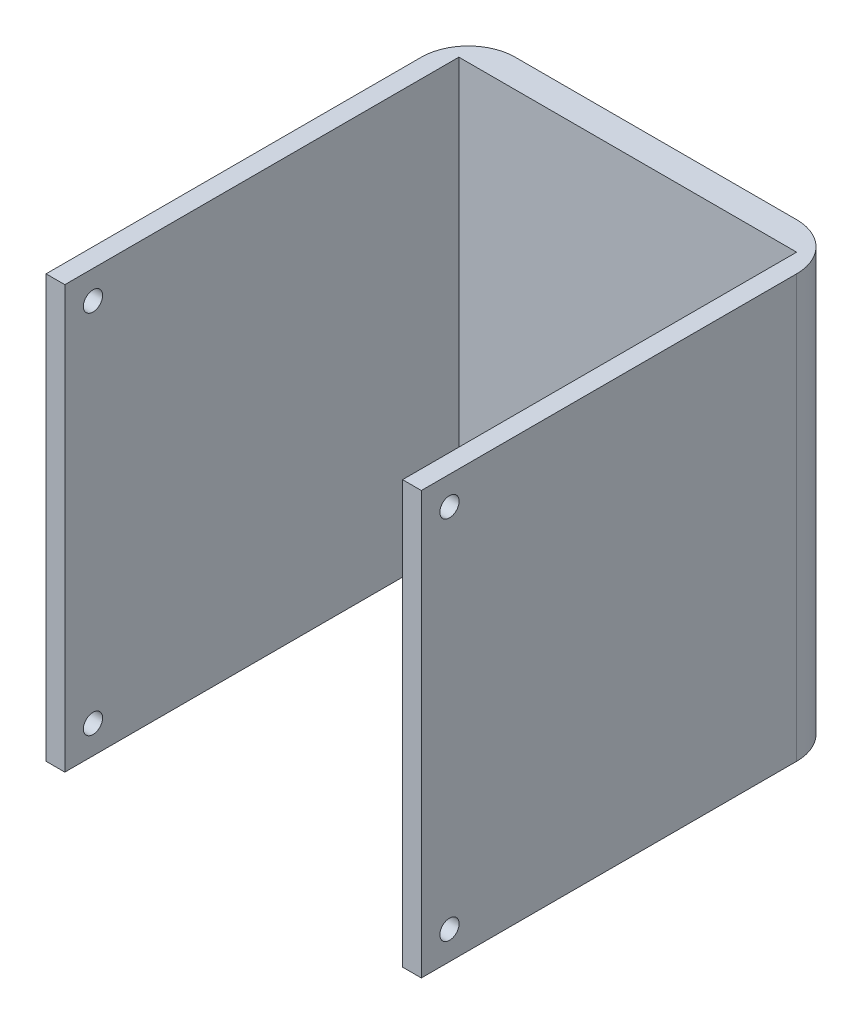
ISO-10303-21;
HEADER;
FILE_DESCRIPTION(('STEP AP214'),'2;1');
FILE_NAME('part.step','',(''),(''),'','','');
FILE_SCHEMA(('AUTOMOTIVE_DESIGN { 1 0 10303 214 1 1 1 1 }'));
ENDSEC;
DATA;
#1=APPLICATION_CONTEXT('core data for automotive mechanical design processes');
#2=APPLICATION_PROTOCOL_DEFINITION('international standard','automotive_design',2000,#1);
#3=PRODUCT_CONTEXT('',#1,'mechanical');
#4=PRODUCT('Part','Part','',(#3));
#5=PRODUCT_RELATED_PRODUCT_CATEGORY('part','',(#4));
#6=PRODUCT_DEFINITION_FORMATION('','',#4);
#7=PRODUCT_DEFINITION_CONTEXT('part definition',#1,'design');
#8=PRODUCT_DEFINITION('design','',#6,#7);
#9=PRODUCT_DEFINITION_SHAPE('','',#8);
#10=(LENGTH_UNIT() NAMED_UNIT(*) SI_UNIT(.MILLI.,.METRE.));
#11=(NAMED_UNIT(*) PLANE_ANGLE_UNIT() SI_UNIT($,.RADIAN.));
#12=(NAMED_UNIT(*) SI_UNIT($,.STERADIAN.) SOLID_ANGLE_UNIT());
#13=UNCERTAINTY_MEASURE_WITH_UNIT(LENGTH_MEASURE(1.E-05),#10,'distance_accuracy_value','');
#14=(GEOMETRIC_REPRESENTATION_CONTEXT(3) GLOBAL_UNCERTAINTY_ASSIGNED_CONTEXT((#13)) GLOBAL_UNIT_ASSIGNED_CONTEXT((#10,
#11,#12)) REPRESENTATION_CONTEXT('',''));
#15=CARTESIAN_POINT('',(0.,0.,0.));
#16=DIRECTION('',(0.,0.,1.));
#17=DIRECTION('',(1.,0.,0.));
#18=AXIS2_PLACEMENT_3D('',#15,#16,#17);
#19=CARTESIAN_POINT('',(20.4545454545455,0.,0.));
#20=DIRECTION('',(0.,1.,0.));
#21=DIRECTION('',(-1.,0.,0.));
#22=AXIS2_PLACEMENT_3D('',#19,#20,#21);
#23=CYLINDRICAL_SURFACE('',#22,5.);
#24=DIRECTION('',(0.,-1.,0.));
#25=VECTOR('',#24,1.);
#26=CARTESIAN_POINT('',(20.4545454545455,0.,-5.));
#27=LINE('',#26,#25);
#28=CARTESIAN_POINT('',(20.4545454545455,16.9090909090909,-5.));
#29=VERTEX_POINT('',#28);
#30=CARTESIAN_POINT('',(20.4545454545455,-28.0909090909091,-5.));
#31=VERTEX_POINT('',#30);
#32=EDGE_CURVE('E228',#29,#31,#27,.T.);
#33=ORIENTED_EDGE('',*,*,#32,.F.);
#34=CARTESIAN_POINT('',(20.4545454545455,16.9090909090909,0.));
#35=DIRECTION('',(0.,-1.,0.));
#36=DIRECTION('',(0.,0.,-1.));
#37=AXIS2_PLACEMENT_3D('',#34,#35,#36);
#38=CIRCLE('',#37,5.);
#39=CARTESIAN_POINT('',(25.4545454545455,16.9090909090909,0.));
#40=VERTEX_POINT('',#39);
#41=EDGE_CURVE('E47',#40,#29,#38,.F.);
#42=ORIENTED_EDGE('',*,*,#41,.F.);
#43=DIRECTION('',(0.,-1.,0.));
#44=VECTOR('',#43,1.);
#45=CARTESIAN_POINT('',(25.4545454545455,0.,0.));
#46=LINE('',#45,#44);
#47=CARTESIAN_POINT('',(25.4545454545455,-28.0909090909091,0.));
#48=VERTEX_POINT('',#47);
#49=EDGE_CURVE('E232',#48,#40,#46,.F.);
#50=ORIENTED_EDGE('',*,*,#49,.F.);
#51=CARTESIAN_POINT('',(20.4545454545455,-28.0909090909091,0.));
#52=DIRECTION('',(0.,-1.,0.));
#53=DIRECTION('',(0.,0.,-1.));
#54=AXIS2_PLACEMENT_3D('',#51,#52,#53);
#55=CIRCLE('',#54,5.);
#56=EDGE_CURVE('E11',#31,#48,#55,.T.);
#57=ORIENTED_EDGE('',*,*,#56,.F.);
#58=EDGE_LOOP('',(#33,#42,#50,#57));
#59=FACE_BOUND('',#58,.T.);
#60=ADVANCED_FACE('F39',(#59),#23,.T.);
#61=CARTESIAN_POINT('',(-9.54545454545454,0.,0.));
#62=DIRECTION('',(0.,1.,0.));
#63=DIRECTION('',(-1.,0.,0.));
#64=AXIS2_PLACEMENT_3D('',#61,#62,#63);
#65=CYLINDRICAL_SURFACE('',#64,5.);
#66=DIRECTION('',(0.,1.,0.));
#67=VECTOR('',#66,1.);
#68=CARTESIAN_POINT('',(-9.54545454545454,0.,-5.));
#69=LINE('',#68,#67);
#70=CARTESIAN_POINT('',(-9.54545454545454,-28.0909090909091,-5.));
#71=VERTEX_POINT('',#70);
#72=CARTESIAN_POINT('',(-9.54545454545455,16.9090909090909,-5.));
#73=VERTEX_POINT('',#72);
#74=EDGE_CURVE('E214',#71,#73,#69,.T.);
#75=ORIENTED_EDGE('',*,*,#74,.F.);
#76=CARTESIAN_POINT('',(-9.54545454545454,-28.0909090909091,0.));
#77=DIRECTION('',(0.,-1.,0.));
#78=DIRECTION('',(0.,0.,-1.));
#79=AXIS2_PLACEMENT_3D('',#76,#77,#78);
#80=CIRCLE('',#79,5.);
#81=CARTESIAN_POINT('',(-14.5454545454545,-28.0909090909091,0.));
#82=VERTEX_POINT('',#81);
#83=EDGE_CURVE('E222',#82,#71,#80,.T.);
#84=ORIENTED_EDGE('',*,*,#83,.F.);
#85=DIRECTION('',(0.,1.,0.));
#86=VECTOR('',#85,1.);
#87=CARTESIAN_POINT('',(-14.5454545454545,16.9090909090909,0.));
#88=LINE('',#87,#86);
#89=CARTESIAN_POINT('',(-14.5454545454545,16.9090909090909,0.));
#90=VERTEX_POINT('',#89);
#91=EDGE_CURVE('E218',#90,#82,#88,.F.);
#92=ORIENTED_EDGE('',*,*,#91,.F.);
#93=CARTESIAN_POINT('',(-9.54545454545454,16.9090909090909,0.));
#94=DIRECTION('',(0.,-1.,0.));
#95=DIRECTION('',(0.,0.,-1.));
#96=AXIS2_PLACEMENT_3D('',#93,#94,#95);
#97=CIRCLE('',#96,5.);
#98=EDGE_CURVE('E225',#73,#90,#97,.F.);
#99=ORIENTED_EDGE('',*,*,#98,.F.);
#100=EDGE_LOOP('',(#75,#84,#92,#99));
#101=FACE_BOUND('',#100,.T.);
#102=ADVANCED_FACE('F245',(#101),#65,.T.);
#103=CARTESIAN_POINT('',(0.,0.,40.));
#104=DIRECTION('',(0.,0.,-1.));
#105=DIRECTION('',(-1.,0.,0.));
#106=AXIS2_PLACEMENT_3D('',#103,#104,#105);
#107=PLANE('',#106);
#108=DIRECTION('',(1.,0.,0.));
#109=VECTOR('',#108,1.);
#110=CARTESIAN_POINT('',(-14.5454545454545,-28.0909090909091,40.));
#111=LINE('',#110,#109);
#112=CARTESIAN_POINT('',(-14.5454545454545,-28.0909090909091,40.));
#113=VERTEX_POINT('',#112);
#114=CARTESIAN_POINT('',(-12.5454545454545,-28.0909090909091,40.));
#115=VERTEX_POINT('',#114);
#116=EDGE_CURVE('E176',#113,#115,#111,.T.);
#117=ORIENTED_EDGE('',*,*,#116,.T.);
#118=DIRECTION('',(0.,1.,0.));
#119=VECTOR('',#118,1.);
#120=CARTESIAN_POINT('',(-12.5454545454545,0.,40.));
#121=LINE('',#120,#119);
#122=CARTESIAN_POINT('',(-12.5454545454545,16.9090909090909,40.));
#123=VERTEX_POINT('',#122);
#124=EDGE_CURVE('E207',#115,#123,#121,.T.);
#125=ORIENTED_EDGE('',*,*,#124,.T.);
#126=DIRECTION('',(1.,0.,0.));
#127=VECTOR('',#126,1.);
#128=CARTESIAN_POINT('',(-14.5454545454545,16.9090909090909,40.));
#129=LINE('',#128,#127);
#130=CARTESIAN_POINT('',(-14.5454545454545,16.9090909090909,40.));
#131=VERTEX_POINT('',#130);
#132=EDGE_CURVE('E167',#131,#123,#129,.T.);
#133=ORIENTED_EDGE('',*,*,#132,.F.);
#134=DIRECTION('',(0.,-1.,0.));
#135=VECTOR('',#134,1.);
#136=CARTESIAN_POINT('',(-14.5454545454545,16.9090909090909,40.));
#137=LINE('',#136,#135);
#138=EDGE_CURVE('E180',#131,#113,#137,.T.);
#139=ORIENTED_EDGE('',*,*,#138,.T.);
#140=EDGE_LOOP('',(#117,#125,#133,#139));
#141=FACE_BOUND('',#140,.T.);
#142=ADVANCED_FACE('F255',(#141),#107,.F.);
#143=CARTESIAN_POINT('',(-14.5454545454545,16.9090909090909,-5.));
#144=DIRECTION('',(0.,-1.,0.));
#145=DIRECTION('',(0.,0.,-1.));
#146=AXIS2_PLACEMENT_3D('',#143,#144,#145);
#147=PLANE('',#146);
#148=DIRECTION('',(0.,0.,1.));
#149=VECTOR('',#148,1.);
#150=CARTESIAN_POINT('',(25.4545454545455,16.9090909090909,-5.));
#151=LINE('',#150,#149);
#152=CARTESIAN_POINT('',(25.4545454545455,16.9090909090909,40.));
#153=VERTEX_POINT('',#152);
#154=EDGE_CURVE('E200',#40,#153,#151,.T.);
#155=ORIENTED_EDGE('',*,*,#154,.F.);
#156=ORIENTED_EDGE('',*,*,#41,.T.);
#157=DIRECTION('',(1.,0.,0.));
#158=VECTOR('',#157,1.);
#159=CARTESIAN_POINT('',(-14.5454545454545,16.9090909090909,-5.));
#160=LINE('',#159,#158);
#161=EDGE_CURVE('E184',#73,#29,#160,.T.);
#162=ORIENTED_EDGE('',*,*,#161,.F.);
#163=ORIENTED_EDGE('',*,*,#98,.T.);
#164=DIRECTION('',(0.,0.,1.));
#165=VECTOR('',#164,1.);
#166=CARTESIAN_POINT('',(-14.5454545454545,16.9090909090909,-5.));
#167=LINE('',#166,#165);
#168=EDGE_CURVE('E191',#90,#131,#167,.T.);
#169=ORIENTED_EDGE('',*,*,#168,.T.);
#170=ORIENTED_EDGE('',*,*,#132,.T.);
#171=DIRECTION('',(0.,0.,1.));
#172=VECTOR('',#171,1.);
#173=CARTESIAN_POINT('',(-12.5454545454545,16.9090909090909,3.));
#174=LINE('',#173,#172);
#175=CARTESIAN_POINT('',(-12.5454545454545,16.9090909090909,-2.));
#176=VERTEX_POINT('',#175);
#177=EDGE_CURVE('E256',#176,#123,#174,.T.);
#178=ORIENTED_EDGE('',*,*,#177,.F.);
#179=DIRECTION('',(-1.,0.,0.));
#180=VECTOR('',#179,1.);
#181=CARTESIAN_POINT('',(-12.5454545454545,16.9090909090909,-2.));
#182=LINE('',#181,#180);
#183=CARTESIAN_POINT('',(23.4545454545454,16.9090909090909,-2.));
#184=VERTEX_POINT('',#183);
#185=EDGE_CURVE('E137',#184,#176,#182,.T.);
#186=ORIENTED_EDGE('',*,*,#185,.F.);
#187=DIRECTION('',(0.,0.,-1.));
#188=VECTOR('',#187,1.);
#189=CARTESIAN_POINT('',(23.4545454545455,16.9090909090909,3.));
#190=LINE('',#189,#188);
#191=CARTESIAN_POINT('',(23.4545454545455,16.9090909090909,40.));
#192=VERTEX_POINT('',#191);
#193=EDGE_CURVE('E159',#192,#184,#190,.T.);
#194=ORIENTED_EDGE('',*,*,#193,.F.);
#195=EDGE_CURVE('E166',#192,#153,#129,.T.);
#196=ORIENTED_EDGE('',*,*,#195,.T.);
#197=EDGE_LOOP('',(#155,#156,#162,#163,#169,#170,#178,#186,#194,#196));
#198=FACE_BOUND('',#197,.T.);
#199=ADVANCED_FACE('F238',(#198),#147,.F.);
#200=CARTESIAN_POINT('',(25.4545454545455,16.9090909090909,-5.));
#201=DIRECTION('',(-1.,0.,0.));
#202=DIRECTION('',(0.,-1.,0.));
#203=AXIS2_PLACEMENT_3D('',#200,#201,#202);
#204=PLANE('',#203);
#205=CARTESIAN_POINT('',(25.4545454545455,13.9090909090909,37.));
#206=DIRECTION('',(1.,0.,0.));
#207=DIRECTION('',(0.,1.,0.));
#208=AXIS2_PLACEMENT_3D('',#205,#206,#207);
#209=CIRCLE('',#208,1.025);
#210=CARTESIAN_POINT('',(25.4545454545455,14.9340909090909,37.));
#211=VERTEX_POINT('',#210);
#212=EDGE_CURVE('E283',#211,#211,#209,.T.);
#213=ORIENTED_EDGE('',*,*,#212,.F.);
#214=EDGE_LOOP('',(#213));
#215=FACE_BOUND('',#214,.T.);
#216=CARTESIAN_POINT('',(25.4545454545455,-25.0909090909091,37.));
#217=DIRECTION('',(1.,0.,0.));
#218=DIRECTION('',(0.,1.,0.));
#219=AXIS2_PLACEMENT_3D('',#216,#217,#218);
#220=CIRCLE('',#219,1.025);
#221=CARTESIAN_POINT('',(25.4545454545455,-24.0659090909091,37.));
#222=VERTEX_POINT('',#221);
#223=EDGE_CURVE('E275',#222,#222,#220,.T.);
#224=ORIENTED_EDGE('',*,*,#223,.F.);
#225=EDGE_LOOP('',(#224));
#226=FACE_BOUND('',#225,.T.);
#227=DIRECTION('',(0.,0.,1.));
#228=VECTOR('',#227,1.);
#229=CARTESIAN_POINT('',(25.4545454545455,-28.0909090909091,-5.));
#230=LINE('',#229,#228);
#231=CARTESIAN_POINT('',(25.4545454545455,-28.0909090909091,40.));
#232=VERTEX_POINT('',#231);
#233=EDGE_CURVE('E197',#48,#232,#230,.T.);
#234=ORIENTED_EDGE('',*,*,#233,.F.);
#235=ORIENTED_EDGE('',*,*,#49,.T.);
#236=ORIENTED_EDGE('',*,*,#154,.T.);
#237=DIRECTION('',(0.,-1.,0.));
#238=VECTOR('',#237,1.);
#239=CARTESIAN_POINT('',(25.4545454545455,16.9090909090909,40.));
#240=LINE('',#239,#238);
#241=EDGE_CURVE('E171',#153,#232,#240,.T.);
#242=ORIENTED_EDGE('',*,*,#241,.T.);
#243=EDGE_LOOP('',(#234,#235,#236,#242));
#244=FACE_BOUND('',#243,.T.);
#245=ADVANCED_FACE('F338',(#215,#226,#244),#204,.F.);
#246=CARTESIAN_POINT('',(-14.5454545454545,-28.0909090909091,-5.));
#247=DIRECTION('',(0.,-1.,0.));
#248=DIRECTION('',(0.,0.,-1.));
#249=AXIS2_PLACEMENT_3D('',#246,#247,#248);
#250=PLANE('',#249);
#251=DIRECTION('',(1.,0.,0.));
#252=VECTOR('',#251,1.);
#253=CARTESIAN_POINT('',(-14.5454545454545,-28.0909090909091,-5.));
#254=LINE('',#253,#252);
#255=EDGE_CURVE('E188',#71,#31,#254,.T.);
#256=ORIENTED_EDGE('',*,*,#255,.T.);
#257=ORIENTED_EDGE('',*,*,#56,.T.);
#258=ORIENTED_EDGE('',*,*,#233,.T.);
#259=CARTESIAN_POINT('',(23.4545454545455,-28.0909090909091,40.));
#260=VERTEX_POINT('',#259);
#261=EDGE_CURVE('E175',#260,#232,#111,.T.);
#262=ORIENTED_EDGE('',*,*,#261,.F.);
#263=DIRECTION('',(0.,0.,1.));
#264=VECTOR('',#263,1.);
#265=CARTESIAN_POINT('',(23.4545454545455,-28.0909090909091,-5.00000000000001));
#266=LINE('',#265,#264);
#267=CARTESIAN_POINT('',(23.4545454545455,-28.0909090909091,3.));
#268=VERTEX_POINT('',#267);
#269=EDGE_CURVE('E154',#268,#260,#266,.T.);
#270=ORIENTED_EDGE('',*,*,#269,.F.);
#271=DIRECTION('',(1.,0.,0.));
#272=VECTOR('',#271,1.);
#273=CARTESIAN_POINT('',(-14.5454545454545,-28.0909090909091,3.));
#274=LINE('',#273,#272);
#275=CARTESIAN_POINT('',(-12.5454545454545,-28.0909090909091,3.));
#276=VERTEX_POINT('',#275);
#277=EDGE_CURVE('E211',#276,#268,#274,.T.);
#278=ORIENTED_EDGE('',*,*,#277,.F.);
#279=DIRECTION('',(0.,0.,-1.));
#280=VECTOR('',#279,1.);
#281=CARTESIAN_POINT('',(-12.5454545454545,-28.0909090909091,-5.));
#282=LINE('',#281,#280);
#283=EDGE_CURVE('E152',#115,#276,#282,.T.);
#284=ORIENTED_EDGE('',*,*,#283,.F.);
#285=ORIENTED_EDGE('',*,*,#116,.F.);
#286=DIRECTION('',(0.,0.,1.));
#287=VECTOR('',#286,1.);
#288=CARTESIAN_POINT('',(-14.5454545454545,-28.0909090909091,-5.));
#289=LINE('',#288,#287);
#290=EDGE_CURVE('E194',#82,#113,#289,.T.);
#291=ORIENTED_EDGE('',*,*,#290,.F.);
#292=ORIENTED_EDGE('',*,*,#83,.T.);
#293=EDGE_LOOP('',(#256,#257,#258,#262,#270,#278,#284,#285,#291,#292));
#294=FACE_BOUND('',#293,.T.);
#295=ADVANCED_FACE('F257',(#294),#250,.T.);
#296=CARTESIAN_POINT('',(-14.5454545454545,16.9090909090909,-5.));
#297=DIRECTION('',(-1.,0.,0.));
#298=DIRECTION('',(0.,-1.,0.));
#299=AXIS2_PLACEMENT_3D('',#296,#297,#298);
#300=PLANE('',#299);
#301=CARTESIAN_POINT('',(-14.5454545454545,13.9090909090909,37.));
#302=DIRECTION('',(-1.,0.,0.));
#303=DIRECTION('',(0.,-1.,0.));
#304=AXIS2_PLACEMENT_3D('',#301,#302,#303);
#305=CIRCLE('',#304,1.025);
#306=CARTESIAN_POINT('',(-14.5454545454545,12.8840909090909,37.));
#307=VERTEX_POINT('',#306);
#308=EDGE_CURVE('E298',#307,#307,#305,.T.);
#309=ORIENTED_EDGE('',*,*,#308,.F.);
#310=EDGE_LOOP('',(#309));
#311=FACE_BOUND('',#310,.T.);
#312=CARTESIAN_POINT('',(-14.5454545454545,-25.0909090909091,37.));
#313=DIRECTION('',(-1.,0.,0.));
#314=DIRECTION('',(0.,-1.,0.));
#315=AXIS2_PLACEMENT_3D('',#312,#313,#314);
#316=CIRCLE('',#315,1.025);
#317=CARTESIAN_POINT('',(-14.5454545454545,-26.1159090909091,37.));
#318=VERTEX_POINT('',#317);
#319=EDGE_CURVE('E282',#318,#318,#316,.T.);
#320=ORIENTED_EDGE('',*,*,#319,.F.);
#321=EDGE_LOOP('',(#320));
#322=FACE_BOUND('',#321,.T.);
#323=ORIENTED_EDGE('',*,*,#168,.F.);
#324=ORIENTED_EDGE('',*,*,#91,.T.);
#325=ORIENTED_EDGE('',*,*,#290,.T.);
#326=ORIENTED_EDGE('',*,*,#138,.F.);
#327=EDGE_LOOP('',(#323,#324,#325,#326));
#328=FACE_BOUND('',#327,.T.);
#329=ADVANCED_FACE('F251',(#311,#322,#328),#300,.T.);
#330=CARTESIAN_POINT('',(0.,0.,-5.));
#331=DIRECTION('',(0.,0.,-1.));
#332=DIRECTION('',(-1.,0.,0.));
#333=AXIS2_PLACEMENT_3D('',#330,#331,#332);
#334=PLANE('',#333);
#335=ORIENTED_EDGE('',*,*,#161,.T.);
#336=ORIENTED_EDGE('',*,*,#32,.T.);
#337=ORIENTED_EDGE('',*,*,#255,.F.);
#338=ORIENTED_EDGE('',*,*,#74,.T.);
#339=EDGE_LOOP('',(#335,#336,#337,#338));
#340=FACE_BOUND('',#339,.T.);
#341=ADVANCED_FACE('F242',(#340),#334,.T.);
#342=ORIENTED_EDGE('',*,*,#195,.F.);
#343=DIRECTION('',(0.,-1.,0.));
#344=VECTOR('',#343,1.);
#345=CARTESIAN_POINT('',(23.4545454545455,0.,40.));
#346=LINE('',#345,#344);
#347=EDGE_CURVE('E203',#192,#260,#346,.T.);
#348=ORIENTED_EDGE('',*,*,#347,.T.);
#349=ORIENTED_EDGE('',*,*,#261,.T.);
#350=ORIENTED_EDGE('',*,*,#241,.F.);
#351=EDGE_LOOP('',(#342,#348,#349,#350));
#352=FACE_BOUND('',#351,.T.);
#353=ADVANCED_FACE('F334',(#352),#107,.F.);
#354=CARTESIAN_POINT('',(-12.5454545454545,-33.0909090909091,3.));
#355=DIRECTION('',(-1.,0.,0.));
#356=DIRECTION('',(0.,0.,1.));
#357=AXIS2_PLACEMENT_3D('',#354,#355,#356);
#358=PLANE('',#357);
#359=CARTESIAN_POINT('',(-12.5454545454545,13.9090909090909,37.));
#360=DIRECTION('',(-1.,0.,0.));
#361=DIRECTION('',(0.,-1.,0.));
#362=AXIS2_PLACEMENT_3D('',#359,#360,#361);
#363=CIRCLE('',#362,1.025);
#364=CARTESIAN_POINT('',(-12.5454545454545,12.8840909090909,37.));
#365=VERTEX_POINT('',#364);
#366=EDGE_CURVE('E294',#365,#365,#363,.T.);
#367=ORIENTED_EDGE('',*,*,#366,.T.);
#368=EDGE_LOOP('',(#367));
#369=FACE_BOUND('',#368,.T.);
#370=CARTESIAN_POINT('',(-12.5454545454545,-25.0909090909091,37.));
#371=DIRECTION('',(-1.,0.,0.));
#372=DIRECTION('',(0.,-1.,0.));
#373=AXIS2_PLACEMENT_3D('',#370,#371,#372);
#374=CIRCLE('',#373,1.025);
#375=CARTESIAN_POINT('',(-12.5454545454545,-26.1159090909091,37.));
#376=VERTEX_POINT('',#375);
#377=EDGE_CURVE('E302',#376,#376,#374,.T.);
#378=ORIENTED_EDGE('',*,*,#377,.T.);
#379=EDGE_LOOP('',(#378));
#380=FACE_BOUND('',#379,.T.);
#381=ORIENTED_EDGE('',*,*,#283,.T.);
#382=DIRECTION('',(0.,1.,0.));
#383=VECTOR('',#382,1.);
#384=CARTESIAN_POINT('',(-12.5454545454545,-33.0909090909091,3.));
#385=LINE('',#384,#383);
#386=CARTESIAN_POINT('',(-12.5454545454545,-26.0909090909091,3.));
#387=VERTEX_POINT('',#386);
#388=EDGE_CURVE('E143',#276,#387,#385,.T.);
#389=ORIENTED_EDGE('',*,*,#388,.T.);
#390=DIRECTION('',(0.,0.,1.));
#391=VECTOR('',#390,1.);
#392=CARTESIAN_POINT('',(-12.5454545454545,-26.0909090909091,3.));
#393=LINE('',#392,#391);
#394=CARTESIAN_POINT('',(-12.5454545454545,-26.0909090909091,-2.));
#395=VERTEX_POINT('',#394);
#396=EDGE_CURVE('E125',#395,#387,#393,.T.);
#397=ORIENTED_EDGE('',*,*,#396,.F.);
#398=DIRECTION('',(0.,1.,0.));
#399=VECTOR('',#398,1.);
#400=CARTESIAN_POINT('',(-12.5454545454545,-26.0909090909091,-2.));
#401=LINE('',#400,#399);
#402=EDGE_CURVE('E272',#395,#176,#401,.T.);
#403=ORIENTED_EDGE('',*,*,#402,.T.);
#404=ORIENTED_EDGE('',*,*,#177,.T.);
#405=ORIENTED_EDGE('',*,*,#124,.F.);
#406=EDGE_LOOP('',(#381,#389,#397,#403,#404,#405));
#407=FACE_BOUND('',#406,.T.);
#408=ADVANCED_FACE('F150',(#369,#380,#407),#358,.F.);
#409=CARTESIAN_POINT('',(-12.5454545454545,-33.0909090909091,3.));
#410=DIRECTION('',(0.,0.,-1.));
#411=DIRECTION('',(-1.,0.,0.));
#412=AXIS2_PLACEMENT_3D('',#409,#410,#411);
#413=PLANE('',#412);
#414=DIRECTION('',(0.,1.,0.));
#415=VECTOR('',#414,1.);
#416=CARTESIAN_POINT('',(23.4545454545455,-33.0909090909091,3.));
#417=LINE('',#416,#415);
#418=CARTESIAN_POINT('',(23.4545454545455,-26.0909090909091,3.));
#419=VERTEX_POINT('',#418);
#420=EDGE_CURVE('E146',#268,#419,#417,.T.);
#421=ORIENTED_EDGE('',*,*,#420,.T.);
#422=DIRECTION('',(1.,0.,0.));
#423=VECTOR('',#422,1.);
#424=CARTESIAN_POINT('',(-12.5454545454545,-26.0909090909091,3.));
#425=LINE('',#424,#423);
#426=EDGE_CURVE('E129',#387,#419,#425,.T.);
#427=ORIENTED_EDGE('',*,*,#426,.F.);
#428=ORIENTED_EDGE('',*,*,#388,.F.);
#429=ORIENTED_EDGE('',*,*,#277,.T.);
#430=EDGE_LOOP('',(#421,#427,#428,#429));
#431=FACE_BOUND('',#430,.T.);
#432=ADVANCED_FACE('F142',(#431),#413,.F.);
#433=CARTESIAN_POINT('',(23.4545454545455,-33.0909090909091,3.));
#434=DIRECTION('',(1.,0.,0.));
#435=DIRECTION('',(0.,0.,-1.));
#436=AXIS2_PLACEMENT_3D('',#433,#434,#435);
#437=PLANE('',#436);
#438=CARTESIAN_POINT('',(23.4545454545455,13.9090909090909,37.));
#439=DIRECTION('',(1.,0.,0.));
#440=DIRECTION('',(0.,1.,0.));
#441=AXIS2_PLACEMENT_3D('',#438,#439,#440);
#442=CIRCLE('',#441,1.025);
#443=CARTESIAN_POINT('',(23.4545454545455,14.9340909090909,37.));
#444=VERTEX_POINT('',#443);
#445=EDGE_CURVE('E278',#444,#444,#442,.T.);
#446=ORIENTED_EDGE('',*,*,#445,.T.);
#447=EDGE_LOOP('',(#446));
#448=FACE_BOUND('',#447,.T.);
#449=CARTESIAN_POINT('',(23.4545454545455,-25.0909090909091,37.));
#450=DIRECTION('',(1.,0.,0.));
#451=DIRECTION('',(0.,1.,0.));
#452=AXIS2_PLACEMENT_3D('',#449,#450,#451);
#453=CIRCLE('',#452,1.025);
#454=CARTESIAN_POINT('',(23.4545454545455,-24.0659090909091,37.));
#455=VERTEX_POINT('',#454);
#456=EDGE_CURVE('E287',#455,#455,#453,.T.);
#457=ORIENTED_EDGE('',*,*,#456,.T.);
#458=EDGE_LOOP('',(#457));
#459=FACE_BOUND('',#458,.T.);
#460=ORIENTED_EDGE('',*,*,#269,.T.);
#461=ORIENTED_EDGE('',*,*,#347,.F.);
#462=ORIENTED_EDGE('',*,*,#193,.T.);
#463=DIRECTION('',(0.,1.,0.));
#464=VECTOR('',#463,1.);
#465=CARTESIAN_POINT('',(23.4545454545454,-26.0909090909091,-2.));
#466=LINE('',#465,#464);
#467=CARTESIAN_POINT('',(23.4545454545454,-26.0909090909091,-2.));
#468=VERTEX_POINT('',#467);
#469=EDGE_CURVE('E263',#468,#184,#466,.T.);
#470=ORIENTED_EDGE('',*,*,#469,.F.);
#471=DIRECTION('',(0.,0.,-1.));
#472=VECTOR('',#471,1.);
#473=CARTESIAN_POINT('',(23.4545454545454,-26.0909090909091,3.));
#474=LINE('',#473,#472);
#475=EDGE_CURVE('E148',#419,#468,#474,.T.);
#476=ORIENTED_EDGE('',*,*,#475,.F.);
#477=ORIENTED_EDGE('',*,*,#420,.F.);
#478=EDGE_LOOP('',(#460,#461,#462,#470,#476,#477));
#479=FACE_BOUND('',#478,.T.);
#480=ADVANCED_FACE('F261',(#448,#459,#479),#437,.F.);
#481=CARTESIAN_POINT('',(-12.5454545454545,-25.0909090909091,37.));
#482=DIRECTION('',(-1.,0.,0.));
#483=DIRECTION('',(0.,-1.,0.));
#484=AXIS2_PLACEMENT_3D('',#481,#482,#483);
#485=CYLINDRICAL_SURFACE('',#484,1.025);
#486=ORIENTED_EDGE('',*,*,#377,.F.);
#487=EDGE_LOOP('',(#486));
#488=FACE_BOUND('',#487,.T.);
#489=ORIENTED_EDGE('',*,*,#319,.T.);
#490=EDGE_LOOP('',(#489));
#491=FACE_BOUND('',#490,.T.);
#492=ADVANCED_FACE('F356',(#488,#491),#485,.F.);
#493=CARTESIAN_POINT('',(-12.5454545454545,13.9090909090909,37.));
#494=DIRECTION('',(-1.,0.,0.));
#495=DIRECTION('',(0.,-1.,0.));
#496=AXIS2_PLACEMENT_3D('',#493,#494,#495);
#497=CYLINDRICAL_SURFACE('',#496,1.025);
#498=ORIENTED_EDGE('',*,*,#366,.F.);
#499=EDGE_LOOP('',(#498));
#500=FACE_BOUND('',#499,.T.);
#501=ORIENTED_EDGE('',*,*,#308,.T.);
#502=EDGE_LOOP('',(#501));
#503=FACE_BOUND('',#502,.T.);
#504=ADVANCED_FACE('F362',(#500,#503),#497,.F.);
#505=CARTESIAN_POINT('',(23.4545454545455,-25.0909090909091,37.));
#506=DIRECTION('',(1.,0.,0.));
#507=DIRECTION('',(0.,1.,0.));
#508=AXIS2_PLACEMENT_3D('',#505,#506,#507);
#509=CYLINDRICAL_SURFACE('',#508,1.025);
#510=ORIENTED_EDGE('',*,*,#456,.F.);
#511=EDGE_LOOP('',(#510));
#512=FACE_BOUND('',#511,.T.);
#513=ORIENTED_EDGE('',*,*,#223,.T.);
#514=EDGE_LOOP('',(#513));
#515=FACE_BOUND('',#514,.T.);
#516=ADVANCED_FACE('F323',(#512,#515),#509,.F.);
#517=CARTESIAN_POINT('',(23.4545454545455,13.9090909090909,37.));
#518=DIRECTION('',(1.,0.,0.));
#519=DIRECTION('',(0.,1.,0.));
#520=AXIS2_PLACEMENT_3D('',#517,#518,#519);
#521=CYLINDRICAL_SURFACE('',#520,1.025);
#522=ORIENTED_EDGE('',*,*,#445,.F.);
#523=EDGE_LOOP('',(#522));
#524=FACE_BOUND('',#523,.T.);
#525=ORIENTED_EDGE('',*,*,#212,.T.);
#526=EDGE_LOOP('',(#525));
#527=FACE_BOUND('',#526,.T.);
#528=ADVANCED_FACE('F316',(#524,#527),#521,.F.);
#529=CARTESIAN_POINT('',(-12.5454545454545,-26.0909090909091,-2.));
#530=DIRECTION('',(0.,0.,-1.));
#531=DIRECTION('',(-1.,0.,0.));
#532=AXIS2_PLACEMENT_3D('',#529,#530,#531);
#533=PLANE('',#532);
#534=ORIENTED_EDGE('',*,*,#185,.T.);
#535=ORIENTED_EDGE('',*,*,#402,.F.);
#536=DIRECTION('',(-1.,0.,0.));
#537=VECTOR('',#536,1.);
#538=CARTESIAN_POINT('',(-12.5454545454545,-26.0909090909091,-2.));
#539=LINE('',#538,#537);
#540=EDGE_CURVE('E132',#468,#395,#539,.T.);
#541=ORIENTED_EDGE('',*,*,#540,.F.);
#542=ORIENTED_EDGE('',*,*,#469,.T.);
#543=EDGE_LOOP('',(#534,#535,#541,#542));
#544=FACE_BOUND('',#543,.T.);
#545=ADVANCED_FACE('F314',(#544),#533,.F.);
#546=CARTESIAN_POINT('',(0.,-26.0909090909091,0.));
#547=DIRECTION('',(0.,-1.,0.));
#548=DIRECTION('',(0.,0.,-1.));
#549=AXIS2_PLACEMENT_3D('',#546,#547,#548);
#550=PLANE('',#549);
#551=ORIENTED_EDGE('',*,*,#396,.T.);
#552=ORIENTED_EDGE('',*,*,#426,.T.);
#553=ORIENTED_EDGE('',*,*,#475,.T.);
#554=ORIENTED_EDGE('',*,*,#540,.T.);
#555=EDGE_LOOP('',(#551,#552,#553,#554));
#556=FACE_BOUND('',#555,.T.);
#557=ADVANCED_FACE('F127',(#556),#550,.F.);
#558=CLOSED_SHELL('',(#60,#102,#142,#199,#245,#295,#329,#341,#353,#408,#432,#480,#492,#504,#516,
#528,#545,#557));
#559=MANIFOLD_SOLID_BREP('B2',#558);
#560=ADVANCED_BREP_SHAPE_REPRESENTATION('',(#18,#559),#14);
#561=SHAPE_DEFINITION_REPRESENTATION(#9,#560);
ENDSEC;
END-ISO-10303-21;
